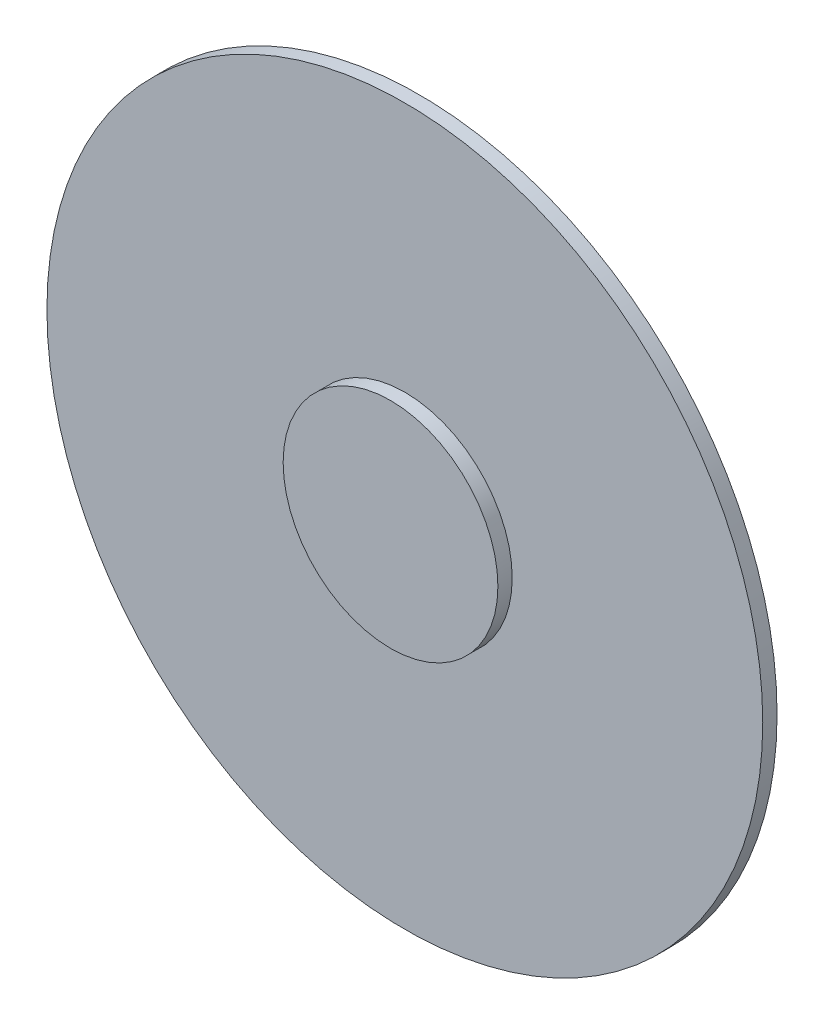
ISO-10303-21;
HEADER;
FILE_DESCRIPTION(('STEP AP214'),'2;1');
FILE_NAME('part.step','',(''),(''),'','','');
FILE_SCHEMA(('AUTOMOTIVE_DESIGN { 1 0 10303 214 1 1 1 1 }'));
ENDSEC;
DATA;
#1=APPLICATION_CONTEXT('core data for automotive mechanical design processes');
#2=APPLICATION_PROTOCOL_DEFINITION('international standard','automotive_design',2000,#1);
#3=PRODUCT_CONTEXT('',#1,'mechanical');
#4=PRODUCT('Part','Part','',(#3));
#5=PRODUCT_RELATED_PRODUCT_CATEGORY('part','',(#4));
#6=PRODUCT_DEFINITION_FORMATION('','',#4);
#7=PRODUCT_DEFINITION_CONTEXT('part definition',#1,'design');
#8=PRODUCT_DEFINITION('design','',#6,#7);
#9=PRODUCT_DEFINITION_SHAPE('','',#8);
#10=(LENGTH_UNIT() NAMED_UNIT(*) SI_UNIT(.MILLI.,.METRE.));
#11=(NAMED_UNIT(*) PLANE_ANGLE_UNIT() SI_UNIT($,.RADIAN.));
#12=(NAMED_UNIT(*) SI_UNIT($,.STERADIAN.) SOLID_ANGLE_UNIT());
#13=UNCERTAINTY_MEASURE_WITH_UNIT(LENGTH_MEASURE(1.E-05),#10,'distance_accuracy_value','');
#14=(GEOMETRIC_REPRESENTATION_CONTEXT(3) GLOBAL_UNCERTAINTY_ASSIGNED_CONTEXT((#13)) GLOBAL_UNIT_ASSIGNED_CONTEXT((#10,
#11,#12)) REPRESENTATION_CONTEXT('',''));
#15=CARTESIAN_POINT('',(0.,0.,0.));
#16=DIRECTION('',(0.,0.,1.));
#17=DIRECTION('',(1.,0.,0.));
#18=AXIS2_PLACEMENT_3D('',#15,#16,#17);
#19=CARTESIAN_POINT('',(0.,0.,1.));
#20=DIRECTION('',(0.,0.,-1.));
#21=DIRECTION('',(-1.,0.,0.));
#22=AXIS2_PLACEMENT_3D('',#19,#20,#21);
#23=CYLINDRICAL_SURFACE('',#22,25.);
#24=CARTESIAN_POINT('',(0.,0.,1.));
#25=DIRECTION('',(0.,0.,1.));
#26=DIRECTION('',(1.,0.,0.));
#27=AXIS2_PLACEMENT_3D('',#24,#25,#26);
#28=CIRCLE('',#27,25.);
#29=CARTESIAN_POINT('',(25.,0.,1.));
#30=VERTEX_POINT('',#29);
#31=EDGE_CURVE('E11',#30,#30,#28,.T.);
#32=ORIENTED_EDGE('',*,*,#31,.F.);
#33=EDGE_LOOP('',(#32));
#34=FACE_BOUND('',#33,.T.);
#35=CARTESIAN_POINT('',(0.,0.,0.));
#36=DIRECTION('',(0.,0.,-1.));
#37=DIRECTION('',(-1.,0.,0.));
#38=AXIS2_PLACEMENT_3D('',#35,#36,#37);
#39=CIRCLE('',#38,25.);
#40=CARTESIAN_POINT('',(-25.,0.,0.));
#41=VERTEX_POINT('',#40);
#42=EDGE_CURVE('E51',#41,#41,#39,.T.);
#43=ORIENTED_EDGE('',*,*,#42,.F.);
#44=EDGE_LOOP('',(#43));
#45=FACE_BOUND('',#44,.T.);
#46=ADVANCED_FACE('F36',(#34,#45),#23,.T.);
#47=CARTESIAN_POINT('',(0.,0.,1.));
#48=DIRECTION('',(0.,0.,1.));
#49=DIRECTION('',(1.,0.,0.));
#50=AXIS2_PLACEMENT_3D('',#47,#48,#49);
#51=PLANE('',#50);
#52=CARTESIAN_POINT('',(0.,0.,1.));
#53=DIRECTION('',(0.,0.,1.));
#54=DIRECTION('',(1.,0.,0.));
#55=AXIS2_PLACEMENT_3D('',#52,#53,#54);
#56=CIRCLE('',#55,7.5);
#57=CARTESIAN_POINT('',(7.5,0.,1.));
#58=VERTEX_POINT('',#57);
#59=EDGE_CURVE('E88',#58,#58,#56,.T.);
#60=ORIENTED_EDGE('',*,*,#59,.F.);
#61=EDGE_LOOP('',(#60));
#62=FACE_BOUND('',#61,.T.);
#63=ORIENTED_EDGE('',*,*,#31,.T.);
#64=EDGE_LOOP('',(#63));
#65=FACE_BOUND('',#64,.T.);
#66=ADVANCED_FACE('F77',(#62,#65),#51,.T.);
#67=CARTESIAN_POINT('',(0.,0.,-5.));
#68=DIRECTION('',(0.,0.,-1.));
#69=DIRECTION('',(-1.,0.,0.));
#70=AXIS2_PLACEMENT_3D('',#67,#68,#69);
#71=PLANE('',#70);
#72=CARTESIAN_POINT('',(0.,0.,-5.));
#73=DIRECTION('',(0.,0.,-1.));
#74=DIRECTION('',(-1.,0.,0.));
#75=AXIS2_PLACEMENT_3D('',#72,#73,#74);
#76=CIRCLE('',#75,10.);
#77=CARTESIAN_POINT('',(-10.,0.,-5.));
#78=VERTEX_POINT('',#77);
#79=EDGE_CURVE('E43',#78,#78,#76,.T.);
#80=ORIENTED_EDGE('',*,*,#79,.T.);
#81=EDGE_LOOP('',(#80));
#82=FACE_BOUND('',#81,.T.);
#83=ADVANCED_FACE('F67',(#82),#71,.T.);
#84=CARTESIAN_POINT('',(0.,0.,-5.));
#85=DIRECTION('',(0.,0.,1.));
#86=DIRECTION('',(1.,0.,0.));
#87=AXIS2_PLACEMENT_3D('',#84,#85,#86);
#88=CONICAL_SURFACE('',#87,10.,1.24904577239825);
#89=ORIENTED_EDGE('',*,*,#42,.T.);
#90=EDGE_LOOP('',(#89));
#91=FACE_BOUND('',#90,.T.);
#92=ORIENTED_EDGE('',*,*,#79,.F.);
#93=EDGE_LOOP('',(#92));
#94=FACE_BOUND('',#93,.T.);
#95=ADVANCED_FACE('F76',(#91,#94),#88,.T.);
#96=CARTESIAN_POINT('',(0.,0.,2.));
#97=DIRECTION('',(0.,0.,-1.));
#98=DIRECTION('',(-1.,0.,0.));
#99=AXIS2_PLACEMENT_3D('',#96,#97,#98);
#100=CYLINDRICAL_SURFACE('',#99,7.5);
#101=CARTESIAN_POINT('',(0.,0.,2.));
#102=DIRECTION('',(0.,0.,1.));
#103=DIRECTION('',(1.,0.,0.));
#104=AXIS2_PLACEMENT_3D('',#101,#102,#103);
#105=CIRCLE('',#104,7.5);
#106=CARTESIAN_POINT('',(7.5,0.,2.));
#107=VERTEX_POINT('',#106);
#108=EDGE_CURVE('E60',#107,#107,#105,.T.);
#109=ORIENTED_EDGE('',*,*,#108,.F.);
#110=EDGE_LOOP('',(#109));
#111=FACE_BOUND('',#110,.T.);
#112=ORIENTED_EDGE('',*,*,#59,.T.);
#113=EDGE_LOOP('',(#112));
#114=FACE_BOUND('',#113,.T.);
#115=ADVANCED_FACE('F106',(#111,#114),#100,.T.);
#116=CARTESIAN_POINT('',(0.,0.,2.));
#117=DIRECTION('',(0.,0.,1.));
#118=DIRECTION('',(1.,0.,0.));
#119=AXIS2_PLACEMENT_3D('',#116,#117,#118);
#120=PLANE('',#119);
#121=ORIENTED_EDGE('',*,*,#108,.T.);
#122=EDGE_LOOP('',(#121));
#123=FACE_BOUND('',#122,.T.);
#124=ADVANCED_FACE('F111',(#123),#120,.T.);
#125=CLOSED_SHELL('',(#46,#66,#83,#95,#115,#124));
#126=MANIFOLD_SOLID_BREP('B2',#125);
#127=ADVANCED_BREP_SHAPE_REPRESENTATION('',(#18,#126),#14);
#128=SHAPE_DEFINITION_REPRESENTATION(#9,#127);
ENDSEC;
END-ISO-10303-21;
